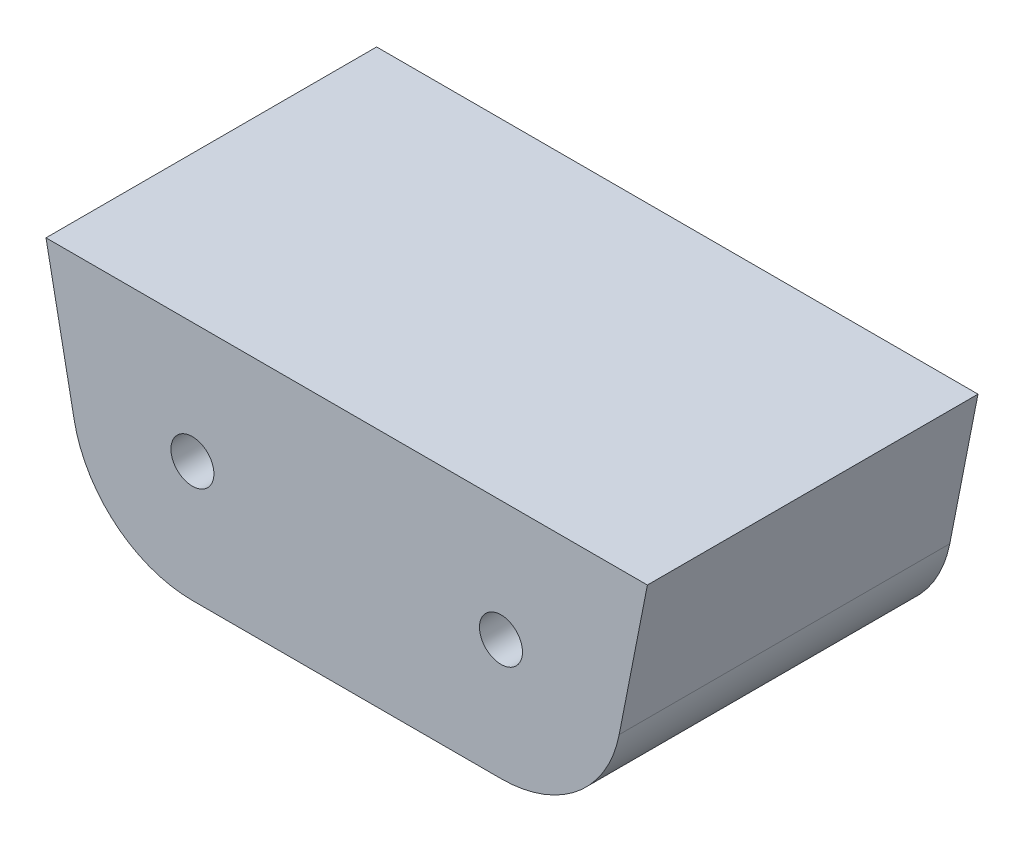
ISO-10303-21;
HEADER;
FILE_DESCRIPTION(('STEP AP214'),'2;1');
FILE_NAME('part.step','',(''),(''),'','','');
FILE_SCHEMA(('AUTOMOTIVE_DESIGN { 1 0 10303 214 1 1 1 1 }'));
ENDSEC;
DATA;
#1=APPLICATION_CONTEXT('core data for automotive mechanical design processes');
#2=APPLICATION_PROTOCOL_DEFINITION('international standard','automotive_design',2000,#1);
#3=PRODUCT_CONTEXT('',#1,'mechanical');
#4=PRODUCT('Part','Part','',(#3));
#5=PRODUCT_RELATED_PRODUCT_CATEGORY('part','',(#4));
#6=PRODUCT_DEFINITION_FORMATION('','',#4);
#7=PRODUCT_DEFINITION_CONTEXT('part definition',#1,'design');
#8=PRODUCT_DEFINITION('design','',#6,#7);
#9=PRODUCT_DEFINITION_SHAPE('','',#8);
#10=(LENGTH_UNIT() NAMED_UNIT(*) SI_UNIT(.MILLI.,.METRE.));
#11=(NAMED_UNIT(*) PLANE_ANGLE_UNIT() SI_UNIT($,.RADIAN.));
#12=(NAMED_UNIT(*) SI_UNIT($,.STERADIAN.) SOLID_ANGLE_UNIT());
#13=UNCERTAINTY_MEASURE_WITH_UNIT(LENGTH_MEASURE(1.E-05),#10,'distance_accuracy_value','');
#14=(GEOMETRIC_REPRESENTATION_CONTEXT(3) GLOBAL_UNCERTAINTY_ASSIGNED_CONTEXT((#13)) GLOBAL_UNIT_ASSIGNED_CONTEXT((#10,
#11,#12)) REPRESENTATION_CONTEXT('',''));
#15=CARTESIAN_POINT('',(0.,0.,0.));
#16=DIRECTION('',(0.,0.,1.));
#17=DIRECTION('',(1.,0.,0.));
#18=AXIS2_PLACEMENT_3D('',#15,#16,#17);
#19=CARTESIAN_POINT('',(53.7957075304828,-10.5651622318046,-19.05));
#20=DIRECTION('',(0.981255208190138,-0.192712782138938,0.));
#21=DIRECTION('',(0.192712782138938,0.981255208190138,0.));
#22=AXIS2_PLACEMENT_3D('',#19,#20,#21);
#23=PLANE('',#22);
#24=DIRECTION('',(0.,0.,1.));
#25=VECTOR('',#24,1.);
#26=CARTESIAN_POINT('',(34.6524356945688,-108.0389,-19.05));
#27=LINE('',#26,#25);
#28=CARTESIAN_POINT('',(34.6524356945688,-108.0389,-19.05));
#29=VERTEX_POINT('',#28);
#30=CARTESIAN_POINT('',(34.6524356945688,-108.0389,19.05));
#31=VERTEX_POINT('',#30);
#32=EDGE_CURVE('E265',#29,#31,#27,.T.);
#33=ORIENTED_EDGE('',*,*,#32,.T.);
#34=DIRECTION('',(0.192712782138939,0.981255208190137,0.));
#35=VECTOR('',#34,1.);
#36=CARTESIAN_POINT('',(34.3531310106004,-109.5629,19.05));
#37=LINE('',#36,#35);
#38=CARTESIAN_POINT('',(31.4009016704081,-124.595065400149,19.05));
#39=VERTEX_POINT('',#38);
#40=EDGE_CURVE('E259',#39,#31,#37,.T.);
#41=ORIENTED_EDGE('',*,*,#40,.F.);
#42=DIRECTION('',(0.,0.,1.));
#43=VECTOR('',#42,1.);
#44=CARTESIAN_POINT('',(31.4009016704081,-124.595065400149,-19.05));
#45=LINE('',#44,#43);
#46=CARTESIAN_POINT('',(31.4009016704081,-124.595065400149,-19.05));
#47=VERTEX_POINT('',#46);
#48=EDGE_CURVE('E14',#47,#39,#45,.T.);
#49=ORIENTED_EDGE('',*,*,#48,.F.);
#50=DIRECTION('',(0.192712782138938,0.981255208190137,0.));
#51=VECTOR('',#50,1.);
#52=CARTESIAN_POINT('',(53.7957075304828,-10.5651622318046,-19.05));
#53=LINE('',#52,#51);
#54=EDGE_CURVE('E341',#47,#29,#53,.T.);
#55=ORIENTED_EDGE('',*,*,#54,.T.);
#56=EDGE_LOOP('',(#33,#41,#49,#55));
#57=FACE_BOUND('',#56,.T.);
#58=ADVANCED_FACE('F172',(#57),#23,.T.);
#59=CARTESIAN_POINT('',(-53.7957075304828,-10.5651622318046,-19.05));
#60=DIRECTION('',(-0.981255208190138,-0.192712782138938,0.));
#61=DIRECTION('',(0.192712782138938,-0.981255208190138,0.));
#62=AXIS2_PLACEMENT_3D('',#59,#60,#61);
#63=PLANE('',#62);
#64=DIRECTION('',(0.192712782138936,-0.981255208190138,0.));
#65=VECTOR('',#64,1.);
#66=CARTESIAN_POINT('',(-34.3531310106004,-109.5629,19.05));
#67=LINE('',#66,#65);
#68=CARTESIAN_POINT('',(-34.6524356945688,-108.0389,19.05));
#69=VERTEX_POINT('',#68);
#70=CARTESIAN_POINT('',(-31.4009016704081,-124.595065400149,19.05));
#71=VERTEX_POINT('',#70);
#72=EDGE_CURVE('E249',#69,#71,#67,.T.);
#73=ORIENTED_EDGE('',*,*,#72,.F.);
#74=DIRECTION('',(0.,0.,1.));
#75=VECTOR('',#74,1.);
#76=CARTESIAN_POINT('',(-34.6524356945688,-108.0389,-19.05));
#77=LINE('',#76,#75);
#78=CARTESIAN_POINT('',(-34.6524356945688,-108.0389,-19.05));
#79=VERTEX_POINT('',#78);
#80=EDGE_CURVE('E266',#79,#69,#77,.T.);
#81=ORIENTED_EDGE('',*,*,#80,.F.);
#82=DIRECTION('',(0.192712782138938,-0.981255208190137,0.));
#83=VECTOR('',#82,1.);
#84=CARTESIAN_POINT('',(-53.7957075304828,-10.5651622318046,-19.05));
#85=LINE('',#84,#83);
#86=CARTESIAN_POINT('',(-31.4009016704081,-124.595065400149,-19.05));
#87=VERTEX_POINT('',#86);
#88=EDGE_CURVE('E330',#79,#87,#85,.T.);
#89=ORIENTED_EDGE('',*,*,#88,.T.);
#90=DIRECTION('',(0.,0.,1.));
#91=VECTOR('',#90,1.);
#92=CARTESIAN_POINT('',(-31.4009016704081,-124.595065400149,-19.05));
#93=LINE('',#92,#91);
#94=EDGE_CURVE('E176',#87,#71,#93,.T.);
#95=ORIENTED_EDGE('',*,*,#94,.T.);
#96=EDGE_LOOP('',(#73,#81,#89,#95));
#97=FACE_BOUND('',#96,.T.);
#98=ADVANCED_FACE('F174',(#97),#63,.T.);
#99=CARTESIAN_POINT('',(0.,0.,-19.05));
#100=DIRECTION('',(0.,0.,1.));
#101=DIRECTION('',(1.,0.,0.));
#102=AXIS2_PLACEMENT_3D('',#99,#100,#101);
#103=PLANE('',#102);
#104=CARTESIAN_POINT('',(17.78,-121.92,-19.05));
#105=DIRECTION('',(0.,0.,1.));
#106=DIRECTION('',(1.,0.,0.));
#107=AXIS2_PLACEMENT_3D('',#104,#105,#106);
#108=CIRCLE('',#107,2.47649999999999);
#109=CARTESIAN_POINT('',(20.2565,-121.92,-19.05));
#110=VERTEX_POINT('',#109);
#111=EDGE_CURVE('E271',#110,#110,#108,.T.);
#112=ORIENTED_EDGE('',*,*,#111,.T.);
#113=EDGE_LOOP('',(#112));
#114=FACE_BOUND('',#113,.T.);
#115=CARTESIAN_POINT('',(-17.78,-121.92,-19.05));
#116=DIRECTION('',(0.,0.,1.));
#117=DIRECTION('',(1.,0.,0.));
#118=AXIS2_PLACEMENT_3D('',#115,#116,#117);
#119=CIRCLE('',#118,2.47649999999999);
#120=CARTESIAN_POINT('',(-15.3035,-121.92,-19.05));
#121=VERTEX_POINT('',#120);
#122=EDGE_CURVE('E276',#121,#121,#119,.T.);
#123=ORIENTED_EDGE('',*,*,#122,.T.);
#124=EDGE_LOOP('',(#123));
#125=FACE_BOUND('',#124,.T.);
#126=DIRECTION('',(1.,0.,0.));
#127=VECTOR('',#126,1.);
#128=CARTESIAN_POINT('',(23.906330007581,-108.0389,-19.05));
#129=LINE('',#128,#127);
#130=EDGE_CURVE('E268',#79,#29,#129,.T.);
#131=ORIENTED_EDGE('',*,*,#130,.T.);
#132=ORIENTED_EDGE('',*,*,#54,.F.);
#133=CARTESIAN_POINT('',(17.78,-121.92,-19.05));
#134=DIRECTION('',(0.,0.,1.));
#135=DIRECTION('',(1.,0.,0.));
#136=AXIS2_PLACEMENT_3D('',#133,#134,#135);
#137=CIRCLE('',#136,13.8811);
#138=CARTESIAN_POINT('',(17.78,-135.8011,-19.05));
#139=VERTEX_POINT('',#138);
#140=EDGE_CURVE('E339',#139,#47,#137,.T.);
#141=ORIENTED_EDGE('',*,*,#140,.F.);
#142=DIRECTION('',(1.,0.,0.));
#143=VECTOR('',#142,1.);
#144=CARTESIAN_POINT('',(-17.78,-135.8011,-19.05));
#145=LINE('',#144,#143);
#146=CARTESIAN_POINT('',(-17.78,-135.8011,-19.05));
#147=VERTEX_POINT('',#146);
#148=EDGE_CURVE('E335',#147,#139,#145,.T.);
#149=ORIENTED_EDGE('',*,*,#148,.F.);
#150=CARTESIAN_POINT('',(-17.78,-121.92,-19.05));
#151=DIRECTION('',(0.,0.,1.));
#152=DIRECTION('',(-1.,0.,0.));
#153=AXIS2_PLACEMENT_3D('',#150,#151,#152);
#154=CIRCLE('',#153,13.8811);
#155=EDGE_CURVE('E233',#87,#147,#154,.T.);
#156=ORIENTED_EDGE('',*,*,#155,.F.);
#157=ORIENTED_EDGE('',*,*,#88,.F.);
#158=EDGE_LOOP('',(#131,#132,#141,#149,#156,#157));
#159=FACE_BOUND('',#158,.T.);
#160=ADVANCED_FACE('F306',(#114,#125,#159),#103,.F.);
#161=CARTESIAN_POINT('',(17.78,-121.92,-19.05));
#162=DIRECTION('',(0.,0.,1.));
#163=DIRECTION('',(1.,0.,0.));
#164=AXIS2_PLACEMENT_3D('',#161,#162,#163);
#165=CYLINDRICAL_SURFACE('',#164,13.8811);
#166=ORIENTED_EDGE('',*,*,#48,.T.);
#167=CARTESIAN_POINT('',(17.78,-121.92,19.05));
#168=DIRECTION('',(0.,0.,1.));
#169=DIRECTION('',(1.,0.,0.));
#170=AXIS2_PLACEMENT_3D('',#167,#168,#169);
#171=CIRCLE('',#170,13.8811);
#172=CARTESIAN_POINT('',(17.78,-135.8011,19.05));
#173=VERTEX_POINT('',#172);
#174=EDGE_CURVE('E242',#173,#39,#171,.T.);
#175=ORIENTED_EDGE('',*,*,#174,.F.);
#176=DIRECTION('',(0.,0.,1.));
#177=VECTOR('',#176,1.);
#178=CARTESIAN_POINT('',(17.78,-135.8011,-19.05));
#179=LINE('',#178,#177);
#180=EDGE_CURVE('E181',#139,#173,#179,.T.);
#181=ORIENTED_EDGE('',*,*,#180,.F.);
#182=ORIENTED_EDGE('',*,*,#140,.T.);
#183=EDGE_LOOP('',(#166,#175,#181,#182));
#184=FACE_BOUND('',#183,.T.);
#185=ADVANCED_FACE('F311',(#184),#165,.T.);
#186=CARTESIAN_POINT('',(-17.78,-135.8011,-19.05));
#187=DIRECTION('',(0.,-1.,0.));
#188=DIRECTION('',(0.,0.,-1.));
#189=AXIS2_PLACEMENT_3D('',#186,#187,#188);
#190=PLANE('',#189);
#191=ORIENTED_EDGE('',*,*,#180,.T.);
#192=DIRECTION('',(1.,0.,0.));
#193=VECTOR('',#192,1.);
#194=CARTESIAN_POINT('',(17.78,-135.8011,19.05));
#195=LINE('',#194,#193);
#196=CARTESIAN_POINT('',(-17.78,-135.8011,19.05));
#197=VERTEX_POINT('',#196);
#198=EDGE_CURVE('E238',#197,#173,#195,.T.);
#199=ORIENTED_EDGE('',*,*,#198,.F.);
#200=DIRECTION('',(0.,0.,1.));
#201=VECTOR('',#200,1.);
#202=CARTESIAN_POINT('',(-17.78,-135.8011,-19.05));
#203=LINE('',#202,#201);
#204=EDGE_CURVE('E226',#147,#197,#203,.T.);
#205=ORIENTED_EDGE('',*,*,#204,.F.);
#206=ORIENTED_EDGE('',*,*,#148,.T.);
#207=EDGE_LOOP('',(#191,#199,#205,#206));
#208=FACE_BOUND('',#207,.T.);
#209=ADVANCED_FACE('F239',(#208),#190,.T.);
#210=CARTESIAN_POINT('',(-17.78,-121.92,-19.05));
#211=DIRECTION('',(0.,0.,1.));
#212=DIRECTION('',(1.,0.,0.));
#213=AXIS2_PLACEMENT_3D('',#210,#211,#212);
#214=CYLINDRICAL_SURFACE('',#213,13.8811);
#215=ORIENTED_EDGE('',*,*,#204,.T.);
#216=CARTESIAN_POINT('',(-17.78,-121.92,19.05));
#217=DIRECTION('',(0.,0.,1.));
#218=DIRECTION('',(1.,0.,0.));
#219=AXIS2_PLACEMENT_3D('',#216,#217,#218);
#220=CIRCLE('',#219,13.8811);
#221=EDGE_CURVE('E231',#71,#197,#220,.T.);
#222=ORIENTED_EDGE('',*,*,#221,.F.);
#223=ORIENTED_EDGE('',*,*,#94,.F.);
#224=ORIENTED_EDGE('',*,*,#155,.T.);
#225=EDGE_LOOP('',(#215,#222,#223,#224));
#226=FACE_BOUND('',#225,.T.);
#227=ADVANCED_FACE('F228',(#226),#214,.T.);
#228=CARTESIAN_POINT('',(-17.78,-121.92,-19.05));
#229=DIRECTION('',(0.,0.,1.));
#230=DIRECTION('',(1.,0.,0.));
#231=AXIS2_PLACEMENT_3D('',#228,#229,#230);
#232=CYLINDRICAL_SURFACE('',#231,2.47649999999999);
#233=ORIENTED_EDGE('',*,*,#122,.F.);
#234=EDGE_LOOP('',(#233));
#235=FACE_BOUND('',#234,.T.);
#236=CARTESIAN_POINT('',(-17.78,-121.92,19.05));
#237=DIRECTION('',(0.,0.,1.));
#238=DIRECTION('',(1.,0.,0.));
#239=AXIS2_PLACEMENT_3D('',#236,#237,#238);
#240=CIRCLE('',#239,2.47649999999999);
#241=CARTESIAN_POINT('',(-15.3035,-121.92,19.05));
#242=VERTEX_POINT('',#241);
#243=EDGE_CURVE('E250',#242,#242,#240,.T.);
#244=ORIENTED_EDGE('',*,*,#243,.T.);
#245=EDGE_LOOP('',(#244));
#246=FACE_BOUND('',#245,.T.);
#247=ADVANCED_FACE('F316',(#235,#246),#232,.F.);
#248=CARTESIAN_POINT('',(17.78,-121.92,-19.05));
#249=DIRECTION('',(0.,0.,1.));
#250=DIRECTION('',(1.,0.,0.));
#251=AXIS2_PLACEMENT_3D('',#248,#249,#250);
#252=CYLINDRICAL_SURFACE('',#251,2.47649999999999);
#253=ORIENTED_EDGE('',*,*,#111,.F.);
#254=EDGE_LOOP('',(#253));
#255=FACE_BOUND('',#254,.T.);
#256=CARTESIAN_POINT('',(17.78,-121.92,19.05));
#257=DIRECTION('',(0.,0.,1.));
#258=DIRECTION('',(1.,0.,0.));
#259=AXIS2_PLACEMENT_3D('',#256,#257,#258);
#260=CIRCLE('',#259,2.47649999999999);
#261=CARTESIAN_POINT('',(20.2565,-121.92,19.05));
#262=VERTEX_POINT('',#261);
#263=EDGE_CURVE('E254',#262,#262,#260,.T.);
#264=ORIENTED_EDGE('',*,*,#263,.T.);
#265=EDGE_LOOP('',(#264));
#266=FACE_BOUND('',#265,.T.);
#267=ADVANCED_FACE('F289',(#255,#266),#252,.F.);
#268=CARTESIAN_POINT('',(23.906330007581,-108.0389,-19.05));
#269=DIRECTION('',(0.,-1.,0.));
#270=DIRECTION('',(0.,0.,-1.));
#271=AXIS2_PLACEMENT_3D('',#268,#269,#270);
#272=PLANE('',#271);
#273=DIRECTION('',(-1.,0.,0.));
#274=VECTOR('',#273,1.);
#275=CARTESIAN_POINT('',(23.906330007581,-108.0389,19.05));
#276=LINE('',#275,#274);
#277=EDGE_CURVE('E262',#31,#69,#276,.T.);
#278=ORIENTED_EDGE('',*,*,#277,.F.);
#279=ORIENTED_EDGE('',*,*,#32,.F.);
#280=ORIENTED_EDGE('',*,*,#130,.F.);
#281=ORIENTED_EDGE('',*,*,#80,.T.);
#282=EDGE_LOOP('',(#278,#279,#280,#281));
#283=FACE_BOUND('',#282,.T.);
#284=ADVANCED_FACE('F291',(#283),#272,.F.);
#285=CARTESIAN_POINT('',(-17.78,-121.92,19.05));
#286=DIRECTION('',(0.,0.,1.));
#287=DIRECTION('',(1.,0.,0.));
#288=AXIS2_PLACEMENT_3D('',#285,#286,#287);
#289=PLANE('',#288);
#290=ORIENTED_EDGE('',*,*,#243,.F.);
#291=EDGE_LOOP('',(#290));
#292=FACE_BOUND('',#291,.T.);
#293=ORIENTED_EDGE('',*,*,#221,.T.);
#294=ORIENTED_EDGE('',*,*,#198,.T.);
#295=ORIENTED_EDGE('',*,*,#174,.T.);
#296=ORIENTED_EDGE('',*,*,#40,.T.);
#297=ORIENTED_EDGE('',*,*,#277,.T.);
#298=ORIENTED_EDGE('',*,*,#72,.T.);
#299=EDGE_LOOP('',(#293,#294,#295,#296,#297,#298));
#300=FACE_BOUND('',#299,.T.);
#301=ORIENTED_EDGE('',*,*,#263,.F.);
#302=EDGE_LOOP('',(#301));
#303=FACE_BOUND('',#302,.T.);
#304=ADVANCED_FACE('F245',(#292,#300,#303),#289,.T.);
#305=CLOSED_SHELL('',(#58,#98,#160,#185,#209,#227,#247,#267,#284,#304));
#306=MANIFOLD_SOLID_BREP('B2',#305);
#307=ADVANCED_BREP_SHAPE_REPRESENTATION('',(#18,#306),#14);
#308=SHAPE_DEFINITION_REPRESENTATION(#9,#307);
ENDSEC;
END-ISO-10303-21;
